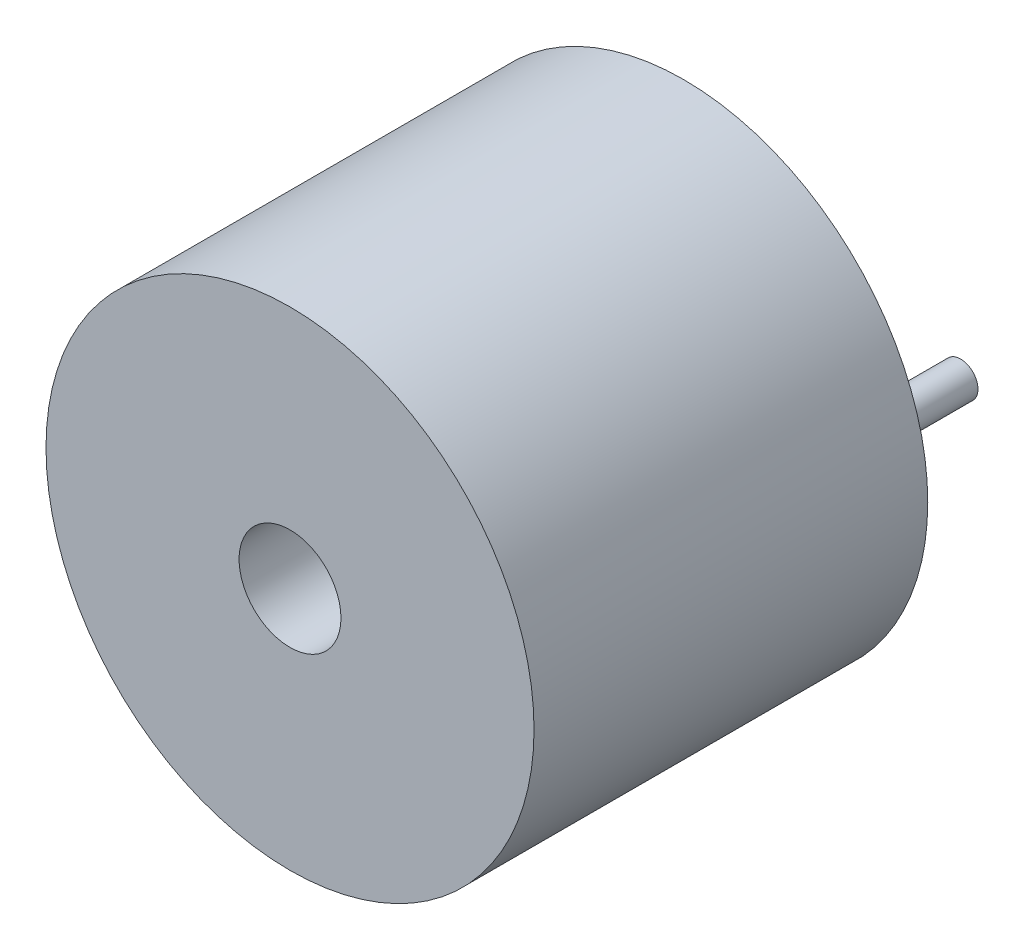
ISO-10303-21;
HEADER;
FILE_DESCRIPTION(('STEP AP214'),'2;1');
FILE_NAME('part.step','',(''),(''),'','','');
FILE_SCHEMA(('AUTOMOTIVE_DESIGN { 1 0 10303 214 1 1 1 1 }'));
ENDSEC;
DATA;
#1=APPLICATION_CONTEXT('core data for automotive mechanical design processes');
#2=APPLICATION_PROTOCOL_DEFINITION('international standard','automotive_design',2000,#1);
#3=PRODUCT_CONTEXT('',#1,'mechanical');
#4=PRODUCT('Part','Part','',(#3));
#5=PRODUCT_RELATED_PRODUCT_CATEGORY('part','',(#4));
#6=PRODUCT_DEFINITION_FORMATION('','',#4);
#7=PRODUCT_DEFINITION_CONTEXT('part definition',#1,'design');
#8=PRODUCT_DEFINITION('design','',#6,#7);
#9=PRODUCT_DEFINITION_SHAPE('','',#8);
#10=(LENGTH_UNIT() NAMED_UNIT(*) SI_UNIT(.MILLI.,.METRE.));
#11=(NAMED_UNIT(*) PLANE_ANGLE_UNIT() SI_UNIT($,.RADIAN.));
#12=(NAMED_UNIT(*) SI_UNIT($,.STERADIAN.) SOLID_ANGLE_UNIT());
#13=UNCERTAINTY_MEASURE_WITH_UNIT(LENGTH_MEASURE(1.E-05),#10,'distance_accuracy_value','');
#14=(GEOMETRIC_REPRESENTATION_CONTEXT(3) GLOBAL_UNCERTAINTY_ASSIGNED_CONTEXT((#13)) GLOBAL_UNIT_ASSIGNED_CONTEXT((#10,
#11,#12)) REPRESENTATION_CONTEXT('',''));
#15=CARTESIAN_POINT('',(0.,0.,0.));
#16=DIRECTION('',(0.,0.,1.));
#17=DIRECTION('',(1.,0.,0.));
#18=AXIS2_PLACEMENT_3D('',#15,#16,#17);
#19=CARTESIAN_POINT('',(0.,0.,0.));
#20=DIRECTION('',(0.,0.,1.));
#21=DIRECTION('',(1.,0.,0.));
#22=AXIS2_PLACEMENT_3D('',#19,#20,#21);
#23=PLANE('',#22);
#24=CARTESIAN_POINT('',(3.75,0.,0.));
#25=DIRECTION('',(0.,0.,1.));
#26=DIRECTION('',(1.,0.,0.));
#27=AXIS2_PLACEMENT_3D('',#24,#25,#26);
#28=CIRCLE('',#27,0.425);
#29=CARTESIAN_POINT('',(4.175,0.,0.));
#30=VERTEX_POINT('',#29);
#31=EDGE_CURVE('E40',#30,#30,#28,.F.);
#32=ORIENTED_EDGE('',*,*,#31,.F.);
#33=EDGE_LOOP('',(#32));
#34=FACE_BOUND('',#33,.T.);
#35=CARTESIAN_POINT('',(0.,0.,0.));
#36=DIRECTION('',(0.,0.,1.));
#37=DIRECTION('',(1.,0.,0.));
#38=AXIS2_PLACEMENT_3D('',#35,#36,#37);
#39=CIRCLE('',#38,5.95);
#40=CARTESIAN_POINT('',(5.95,0.,0.));
#41=VERTEX_POINT('',#40);
#42=EDGE_CURVE('E52',#41,#41,#39,.T.);
#43=ORIENTED_EDGE('',*,*,#42,.F.);
#44=EDGE_LOOP('',(#43));
#45=FACE_BOUND('',#44,.T.);
#46=CARTESIAN_POINT('',(-3.75,0.,0.));
#47=DIRECTION('',(0.,0.,1.));
#48=DIRECTION('',(1.,0.,0.));
#49=AXIS2_PLACEMENT_3D('',#46,#47,#48);
#50=CIRCLE('',#49,0.425);
#51=CARTESIAN_POINT('',(-3.325,0.,0.));
#52=VERTEX_POINT('',#51);
#53=EDGE_CURVE('E10',#52,#52,#50,.F.);
#54=ORIENTED_EDGE('',*,*,#53,.F.);
#55=EDGE_LOOP('',(#54));
#56=FACE_BOUND('',#55,.T.);
#57=ADVANCED_FACE('F32',(#34,#45,#56),#23,.F.);
#58=CARTESIAN_POINT('',(0.,0.,9.6));
#59=DIRECTION('',(0.,0.,-1.));
#60=DIRECTION('',(-1.,0.,0.));
#61=AXIS2_PLACEMENT_3D('',#58,#59,#60);
#62=CYLINDRICAL_SURFACE('',#61,5.95);
#63=CARTESIAN_POINT('',(0.,0.,9.6));
#64=DIRECTION('',(0.,0.,1.));
#65=DIRECTION('',(1.,0.,0.));
#66=AXIS2_PLACEMENT_3D('',#63,#64,#65);
#67=CIRCLE('',#66,5.95);
#68=CARTESIAN_POINT('',(5.95,0.,9.6));
#69=VERTEX_POINT('',#68);
#70=EDGE_CURVE('E46',#69,#69,#67,.T.);
#71=ORIENTED_EDGE('',*,*,#70,.F.);
#72=EDGE_LOOP('',(#71));
#73=FACE_BOUND('',#72,.T.);
#74=ORIENTED_EDGE('',*,*,#42,.T.);
#75=EDGE_LOOP('',(#74));
#76=FACE_BOUND('',#75,.T.);
#77=ADVANCED_FACE('F34',(#73,#76),#62,.T.);
#78=CARTESIAN_POINT('',(0.,0.,9.6));
#79=DIRECTION('',(0.,0.,1.));
#80=DIRECTION('',(1.,0.,0.));
#81=AXIS2_PLACEMENT_3D('',#78,#79,#80);
#82=PLANE('',#81);
#83=CARTESIAN_POINT('',(0.,0.,9.6));
#84=DIRECTION('',(0.,0.,1.));
#85=DIRECTION('',(1.,0.,0.));
#86=AXIS2_PLACEMENT_3D('',#83,#84,#85);
#87=CIRCLE('',#86,1.24195845096508);
#88=CARTESIAN_POINT('',(1.24195845096508,0.,9.6));
#89=VERTEX_POINT('',#88);
#90=EDGE_CURVE('E59',#89,#89,#87,.T.);
#91=ORIENTED_EDGE('',*,*,#90,.F.);
#92=EDGE_LOOP('',(#91));
#93=FACE_BOUND('',#92,.T.);
#94=ORIENTED_EDGE('',*,*,#70,.T.);
#95=EDGE_LOOP('',(#94));
#96=FACE_BOUND('',#95,.T.);
#97=ADVANCED_FACE('F92',(#93,#96),#82,.T.);
#98=CARTESIAN_POINT('',(0.,0.,7.6));
#99=DIRECTION('',(0.,0.,1.));
#100=DIRECTION('',(1.,0.,0.));
#101=AXIS2_PLACEMENT_3D('',#98,#99,#100);
#102=CYLINDRICAL_SURFACE('',#101,1.24195845096508);
#103=CARTESIAN_POINT('',(0.,0.,7.6));
#104=DIRECTION('',(0.,0.,1.));
#105=DIRECTION('',(1.,0.,0.));
#106=AXIS2_PLACEMENT_3D('',#103,#104,#105);
#107=CIRCLE('',#106,1.24195845096508);
#108=CARTESIAN_POINT('',(1.24195845096508,0.,7.6));
#109=VERTEX_POINT('',#108);
#110=EDGE_CURVE('E57',#109,#109,#107,.T.);
#111=ORIENTED_EDGE('',*,*,#110,.F.);
#112=EDGE_LOOP('',(#111));
#113=FACE_BOUND('',#112,.T.);
#114=ORIENTED_EDGE('',*,*,#90,.T.);
#115=EDGE_LOOP('',(#114));
#116=FACE_BOUND('',#115,.T.);
#117=ADVANCED_FACE('F98',(#113,#116),#102,.F.);
#118=CARTESIAN_POINT('',(0.,0.,7.6));
#119=DIRECTION('',(0.,0.,1.));
#120=DIRECTION('',(1.,0.,0.));
#121=AXIS2_PLACEMENT_3D('',#118,#119,#120);
#122=PLANE('',#121);
#123=ORIENTED_EDGE('',*,*,#110,.T.);
#124=EDGE_LOOP('',(#123));
#125=FACE_BOUND('',#124,.T.);
#126=ADVANCED_FACE('F102',(#125),#122,.T.);
#127=CARTESIAN_POINT('',(3.75,0.,-3.));
#128=DIRECTION('',(0.,0.,1.));
#129=DIRECTION('',(1.,0.,0.));
#130=AXIS2_PLACEMENT_3D('',#127,#128,#129);
#131=CYLINDRICAL_SURFACE('',#130,0.425);
#132=CARTESIAN_POINT('',(3.75,0.,-3.));
#133=DIRECTION('',(0.,0.,-1.));
#134=DIRECTION('',(-1.,0.,0.));
#135=AXIS2_PLACEMENT_3D('',#132,#133,#134);
#136=CIRCLE('',#135,0.425);
#137=CARTESIAN_POINT('',(3.325,0.,-3.));
#138=VERTEX_POINT('',#137);
#139=EDGE_CURVE('E63',#138,#138,#136,.T.);
#140=ORIENTED_EDGE('',*,*,#139,.F.);
#141=EDGE_LOOP('',(#140));
#142=FACE_BOUND('',#141,.T.);
#143=ORIENTED_EDGE('',*,*,#31,.T.);
#144=EDGE_LOOP('',(#143));
#145=FACE_BOUND('',#144,.T.);
#146=ADVANCED_FACE('F84',(#142,#145),#131,.T.);
#147=CARTESIAN_POINT('',(3.75,0.,-3.));
#148=DIRECTION('',(0.,0.,-1.));
#149=DIRECTION('',(-1.,0.,0.));
#150=AXIS2_PLACEMENT_3D('',#147,#148,#149);
#151=PLANE('',#150);
#152=ORIENTED_EDGE('',*,*,#139,.T.);
#153=EDGE_LOOP('',(#152));
#154=FACE_BOUND('',#153,.T.);
#155=ADVANCED_FACE('F77',(#154),#151,.T.);
#156=CARTESIAN_POINT('',(-3.75,0.,-3.));
#157=DIRECTION('',(0.,0.,1.));
#158=DIRECTION('',(1.,0.,0.));
#159=AXIS2_PLACEMENT_3D('',#156,#157,#158);
#160=CYLINDRICAL_SURFACE('',#159,0.425);
#161=CARTESIAN_POINT('',(-3.75,0.,-3.));
#162=DIRECTION('',(0.,0.,-1.));
#163=DIRECTION('',(-1.,0.,0.));
#164=AXIS2_PLACEMENT_3D('',#161,#162,#163);
#165=CIRCLE('',#164,0.425);
#166=CARTESIAN_POINT('',(-4.175,0.,-3.));
#167=VERTEX_POINT('',#166);
#168=EDGE_CURVE('E69',#167,#167,#165,.T.);
#169=ORIENTED_EDGE('',*,*,#168,.F.);
#170=EDGE_LOOP('',(#169));
#171=FACE_BOUND('',#170,.T.);
#172=ORIENTED_EDGE('',*,*,#53,.T.);
#173=EDGE_LOOP('',(#172));
#174=FACE_BOUND('',#173,.T.);
#175=ADVANCED_FACE('F75',(#171,#174),#160,.T.);
#176=CARTESIAN_POINT('',(-3.75,0.,-3.));
#177=DIRECTION('',(0.,0.,-1.));
#178=DIRECTION('',(-1.,0.,0.));
#179=AXIS2_PLACEMENT_3D('',#176,#177,#178);
#180=PLANE('',#179);
#181=ORIENTED_EDGE('',*,*,#168,.T.);
#182=EDGE_LOOP('',(#181));
#183=FACE_BOUND('',#182,.T.);
#184=ADVANCED_FACE('F73',(#183),#180,.T.);
#185=CLOSED_SHELL('',(#57,#77,#97,#117,#126,#146,#155,#175,#184));
#186=MANIFOLD_SOLID_BREP('B2',#185);
#187=ADVANCED_BREP_SHAPE_REPRESENTATION('',(#18,#186),#14);
#188=SHAPE_DEFINITION_REPRESENTATION(#9,#187);
ENDSEC;
END-ISO-10303-21;
